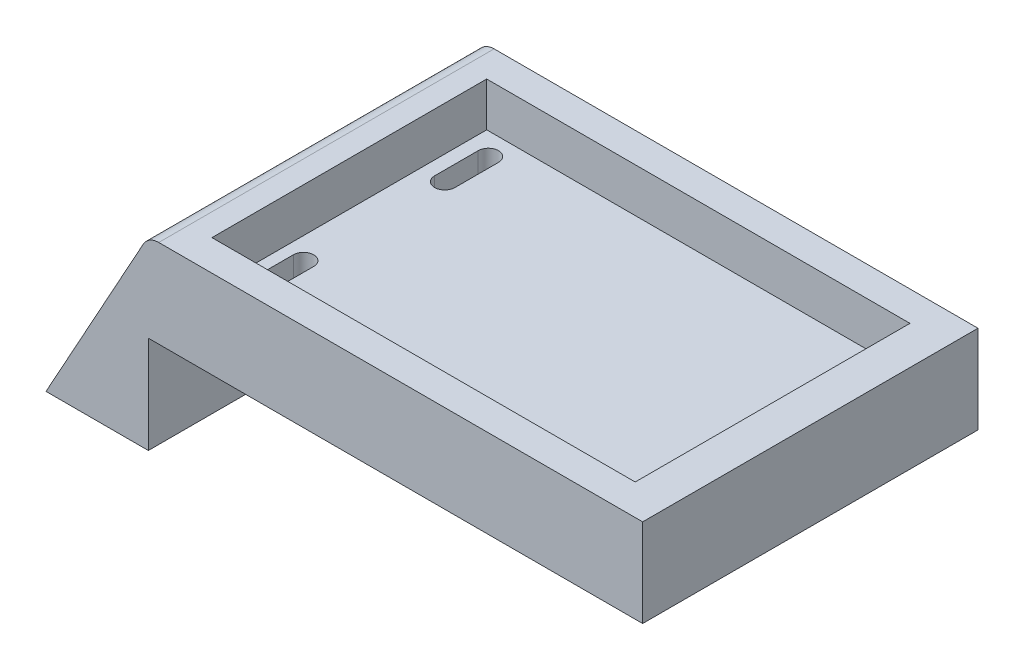
ISO-10303-21;
HEADER;
FILE_DESCRIPTION(('STEP AP214'),'2;1');
FILE_NAME('part.step','',(''),(''),'','','');
FILE_SCHEMA(('AUTOMOTIVE_DESIGN { 1 0 10303 214 1 1 1 1 }'));
ENDSEC;
DATA;
#1=APPLICATION_CONTEXT('core data for automotive mechanical design processes');
#2=APPLICATION_PROTOCOL_DEFINITION('international standard','automotive_design',2000,#1);
#3=PRODUCT_CONTEXT('',#1,'mechanical');
#4=PRODUCT('Part','Part','',(#3));
#5=PRODUCT_RELATED_PRODUCT_CATEGORY('part','',(#4));
#6=PRODUCT_DEFINITION_FORMATION('','',#4);
#7=PRODUCT_DEFINITION_CONTEXT('part definition',#1,'design');
#8=PRODUCT_DEFINITION('design','',#6,#7);
#9=PRODUCT_DEFINITION_SHAPE('','',#8);
#10=(LENGTH_UNIT() NAMED_UNIT(*) SI_UNIT(.MILLI.,.METRE.));
#11=(NAMED_UNIT(*) PLANE_ANGLE_UNIT() SI_UNIT($,.RADIAN.));
#12=(NAMED_UNIT(*) SI_UNIT($,.STERADIAN.) SOLID_ANGLE_UNIT());
#13=UNCERTAINTY_MEASURE_WITH_UNIT(LENGTH_MEASURE(1.E-05),#10,'distance_accuracy_value','');
#14=(GEOMETRIC_REPRESENTATION_CONTEXT(3) GLOBAL_UNCERTAINTY_ASSIGNED_CONTEXT((#13)) GLOBAL_UNIT_ASSIGNED_CONTEXT((#10,
#11,#12)) REPRESENTATION_CONTEXT('',''));
#15=CARTESIAN_POINT('',(0.,0.,0.));
#16=DIRECTION('',(0.,0.,1.));
#17=DIRECTION('',(1.,0.,0.));
#18=AXIS2_PLACEMENT_3D('',#15,#16,#17);
#19=CARTESIAN_POINT('',(-34.7548784400583,-12.7,-21.5329138161231));
#20=DIRECTION('',(0.,0.,-1.));
#21=DIRECTION('',(-1.,0.,0.));
#22=AXIS2_PLACEMENT_3D('',#19,#20,#21);
#23=PLANE('',#22);
#24=CARTESIAN_POINT('',(13.9227090818307,-12.7,-21.5329138161231));
#25=DIRECTION('',(0.,0.,-1.));
#26=DIRECTION('',(-1.,0.,0.));
#27=AXIS2_PLACEMENT_3D('',#24,#25,#26);
#28=CIRCLE('',#27,7.62);
#29=CARTESIAN_POINT('',(6.30270908183067,-12.7,-21.5329138161231));
#30=VERTEX_POINT('',#29);
#31=CARTESIAN_POINT('',(21.5427090818307,-12.7,-21.5329138161231));
#32=VERTEX_POINT('',#31);
#33=EDGE_CURVE('E262',#30,#32,#28,.T.);
#34=ORIENTED_EDGE('',*,*,#33,.F.);
#35=DIRECTION('',(-1.,0.,0.));
#36=VECTOR('',#35,1.);
#37=CARTESIAN_POINT('',(-34.7548784400583,-12.7,-21.5329138161231));
#38=LINE('',#37,#36);
#39=CARTESIAN_POINT('',(-34.7548784400583,-12.7,-21.5329138161231));
#40=VERTEX_POINT('',#39);
#41=EDGE_CURVE('E332',#30,#40,#38,.T.);
#42=ORIENTED_EDGE('',*,*,#41,.T.);
#43=DIRECTION('',(0.,1.,0.));
#44=VECTOR('',#43,1.);
#45=CARTESIAN_POINT('',(-34.7548784400583,-12.7,-21.5329138161231));
#46=LINE('',#45,#44);
#47=CARTESIAN_POINT('',(-34.7548784400583,-26.7296636371694,-21.5329138161231));
#48=VERTEX_POINT('',#47);
#49=EDGE_CURVE('E276',#48,#40,#46,.T.);
#50=ORIENTED_EDGE('',*,*,#49,.F.);
#51=DIRECTION('',(1.,0.,0.));
#52=VECTOR('',#51,1.);
#53=CARTESIAN_POINT('',(-34.7548784400583,-26.7296636371694,-21.5329138161231));
#54=LINE('',#53,#52);
#55=CARTESIAN_POINT('',(-49.5144814985387,-26.7296636371694,-21.5329138161231));
#56=VERTEX_POINT('',#55);
#57=EDGE_CURVE('E377',#56,#48,#54,.T.);
#58=ORIENTED_EDGE('',*,*,#57,.F.);
#59=DIRECTION('',(-0.483383688140556,-0.875408596050801,0.));
#60=VECTOR('',#59,1.);
#61=CARTESIAN_POINT('',(-49.5144814985387,-26.7296636371694,-21.5329138161231));
#62=LINE('',#61,#60);
#63=CARTESIAN_POINT('',(-35.4794528893374,-1.31220543212299,-21.5329138161231));
#64=VERTEX_POINT('',#63);
#65=EDGE_CURVE('E381',#64,#56,#62,.T.);
#66=ORIENTED_EDGE('',*,*,#65,.F.);
#67=CARTESIAN_POINT('',(-33.2559150553684,-2.54,-21.5329138161231));
#68=DIRECTION('',(0.,0.,-1.));
#69=DIRECTION('',(-1.,0.,0.));
#70=AXIS2_PLACEMENT_3D('',#67,#68,#69);
#71=CIRCLE('',#70,2.54);
#72=CARTESIAN_POINT('',(-33.2559150553684,0.,-21.5329138161231));
#73=VERTEX_POINT('',#72);
#74=EDGE_CURVE('E341',#64,#73,#71,.T.);
#75=ORIENTED_EDGE('',*,*,#74,.T.);
#76=DIRECTION('',(-1.,0.,0.));
#77=VECTOR('',#76,1.);
#78=CARTESIAN_POINT('',(-34.7548784400583,0.,-21.5329138161231));
#79=LINE('',#78,#77);
#80=CARTESIAN_POINT('',(36.5178070565831,0.,-21.5329138161231));
#81=VERTEX_POINT('',#80);
#82=EDGE_CURVE('E322',#81,#73,#79,.T.);
#83=ORIENTED_EDGE('',*,*,#82,.F.);
#84=DIRECTION('',(0.,1.,0.));
#85=VECTOR('',#84,1.);
#86=CARTESIAN_POINT('',(36.5178070565831,-12.7,-21.5329138161231));
#87=LINE('',#86,#85);
#88=CARTESIAN_POINT('',(36.5178070565831,-12.7,-21.5329138161231));
#89=VERTEX_POINT('',#88);
#90=EDGE_CURVE('E358',#89,#81,#87,.T.);
#91=ORIENTED_EDGE('',*,*,#90,.F.);
#92=EDGE_CURVE('E329',#89,#32,#38,.T.);
#93=ORIENTED_EDGE('',*,*,#92,.T.);
#94=EDGE_LOOP('',(#34,#42,#50,#58,#66,#75,#83,#91,#93));
#95=FACE_BOUND('',#94,.T.);
#96=ADVANCED_FACE('F33',(#95),#23,.T.);
#97=CARTESIAN_POINT('',(36.5178070565831,-12.7,-21.5329138161231));
#98=DIRECTION('',(1.,0.,0.));
#99=DIRECTION('',(0.,0.,-1.));
#100=AXIS2_PLACEMENT_3D('',#97,#98,#99);
#101=PLANE('',#100);
#102=DIRECTION('',(0.,0.,-1.));
#103=VECTOR('',#102,1.);
#104=CARTESIAN_POINT('',(36.5178070565831,0.,-21.5329138161231));
#105=LINE('',#104,#103);
#106=CARTESIAN_POINT('',(36.5178070565831,0.,26.8216996656972));
#107=VERTEX_POINT('',#106);
#108=EDGE_CURVE('E401',#107,#81,#105,.T.);
#109=ORIENTED_EDGE('',*,*,#108,.F.);
#110=DIRECTION('',(0.,1.,0.));
#111=VECTOR('',#110,1.);
#112=CARTESIAN_POINT('',(36.5178070565831,-12.7,26.8216996656972));
#113=LINE('',#112,#111);
#114=CARTESIAN_POINT('',(36.5178070565831,-12.7,26.8216996656972));
#115=VERTEX_POINT('',#114);
#116=EDGE_CURVE('E323',#115,#107,#113,.T.);
#117=ORIENTED_EDGE('',*,*,#116,.F.);
#118=DIRECTION('',(0.,0.,-1.));
#119=VECTOR('',#118,1.);
#120=CARTESIAN_POINT('',(36.5178070565831,-12.7,-21.5329138161231));
#121=LINE('',#120,#119);
#122=EDGE_CURVE('E314',#115,#89,#121,.T.);
#123=ORIENTED_EDGE('',*,*,#122,.T.);
#124=ORIENTED_EDGE('',*,*,#90,.T.);
#125=EDGE_LOOP('',(#109,#117,#123,#124));
#126=FACE_BOUND('',#125,.T.);
#127=ADVANCED_FACE('F414',(#126),#101,.T.);
#128=CARTESIAN_POINT('',(-34.7548784400583,-12.7,26.8216996656972));
#129=DIRECTION('',(0.,0.,1.));
#130=DIRECTION('',(1.,0.,0.));
#131=AXIS2_PLACEMENT_3D('',#128,#129,#130);
#132=PLANE('',#131);
#133=DIRECTION('',(1.,0.,0.));
#134=VECTOR('',#133,1.);
#135=CARTESIAN_POINT('',(-34.7548784400583,0.,26.8216996656972));
#136=LINE('',#135,#134);
#137=CARTESIAN_POINT('',(-33.2559150553684,0.,26.8216996656972));
#138=VERTEX_POINT('',#137);
#139=EDGE_CURVE('E305',#138,#107,#136,.T.);
#140=ORIENTED_EDGE('',*,*,#139,.F.);
#141=CARTESIAN_POINT('',(-33.2559150553684,-2.54,26.8216996656972));
#142=DIRECTION('',(0.,0.,1.));
#143=DIRECTION('',(1.,0.,0.));
#144=AXIS2_PLACEMENT_3D('',#141,#142,#143);
#145=CIRCLE('',#144,2.54);
#146=CARTESIAN_POINT('',(-35.4794528893374,-1.31220543212299,26.8216996656972));
#147=VERTEX_POINT('',#146);
#148=EDGE_CURVE('E388',#138,#147,#145,.T.);
#149=ORIENTED_EDGE('',*,*,#148,.T.);
#150=DIRECTION('',(-0.483383688140556,-0.875408596050801,0.));
#151=VECTOR('',#150,1.);
#152=CARTESIAN_POINT('',(-49.5144814985387,-26.7296636371694,26.8216996656972));
#153=LINE('',#152,#151);
#154=CARTESIAN_POINT('',(-49.5144814985387,-26.7296636371694,26.8216996656972));
#155=VERTEX_POINT('',#154);
#156=EDGE_CURVE('E275',#147,#155,#153,.T.);
#157=ORIENTED_EDGE('',*,*,#156,.T.);
#158=DIRECTION('',(1.,0.,0.));
#159=VECTOR('',#158,1.);
#160=CARTESIAN_POINT('',(-34.7548784400583,-26.7296636371694,26.8216996656972));
#161=LINE('',#160,#159);
#162=CARTESIAN_POINT('',(-34.7548784400583,-26.7296636371694,26.8216996656972));
#163=VERTEX_POINT('',#162);
#164=EDGE_CURVE('E269',#155,#163,#161,.T.);
#165=ORIENTED_EDGE('',*,*,#164,.T.);
#166=DIRECTION('',(0.,1.,0.));
#167=VECTOR('',#166,1.);
#168=CARTESIAN_POINT('',(-34.7548784400583,-12.7,26.8216996656972));
#169=LINE('',#168,#167);
#170=CARTESIAN_POINT('',(-34.7548784400583,-12.7,26.8216996656972));
#171=VERTEX_POINT('',#170);
#172=EDGE_CURVE('E265',#163,#171,#169,.T.);
#173=ORIENTED_EDGE('',*,*,#172,.T.);
#174=DIRECTION('',(1.,0.,0.));
#175=VECTOR('',#174,1.);
#176=CARTESIAN_POINT('',(-34.7548784400583,-12.7,26.8216996656972));
#177=LINE('',#176,#175);
#178=EDGE_CURVE('E321',#171,#115,#177,.T.);
#179=ORIENTED_EDGE('',*,*,#178,.T.);
#180=ORIENTED_EDGE('',*,*,#116,.T.);
#181=EDGE_LOOP('',(#140,#149,#157,#165,#173,#179,#180));
#182=FACE_BOUND('',#181,.T.);
#183=ADVANCED_FACE('F365',(#182),#132,.T.);
#184=CARTESIAN_POINT('',(0.,-12.7,0.));
#185=DIRECTION('',(0.,1.,0.));
#186=DIRECTION('',(0.,0.,1.));
#187=AXIS2_PLACEMENT_3D('',#184,#185,#186);
#188=PLANE('',#187);
#189=DIRECTION('',(0.,0.,1.));
#190=VECTOR('',#189,1.);
#191=CARTESIAN_POINT('',(-25.4358431669078,-12.7,12.2982140969415));
#192=LINE('',#191,#190);
#193=CARTESIAN_POINT('',(-25.4358431669078,-12.7,12.2982140969415));
#194=VERTEX_POINT('',#193);
#195=CARTESIAN_POINT('',(-25.4358431669078,-12.7,18.5882371670049));
#196=VERTEX_POINT('',#195);
#197=EDGE_CURVE('E210',#194,#196,#192,.T.);
#198=ORIENTED_EDGE('',*,*,#197,.F.);
#199=CARTESIAN_POINT('',(-26.9006430599363,-12.7,12.2982140969415));
#200=DIRECTION('',(0.,1.,0.));
#201=DIRECTION('',(0.,0.,1.));
#202=AXIS2_PLACEMENT_3D('',#199,#200,#201);
#203=CIRCLE('',#202,1.46479989302845);
#204=CARTESIAN_POINT('',(-28.3654429529647,-12.7,12.2982140969415));
#205=VERTEX_POINT('',#204);
#206=EDGE_CURVE('E213',#205,#194,#203,.F.);
#207=ORIENTED_EDGE('',*,*,#206,.F.);
#208=DIRECTION('',(0.,0.,-1.));
#209=VECTOR('',#208,1.);
#210=CARTESIAN_POINT('',(-28.3654429529647,-12.7,12.2982140969415));
#211=LINE('',#210,#209);
#212=CARTESIAN_POINT('',(-28.3654429529647,-12.7,18.5882371670049));
#213=VERTEX_POINT('',#212);
#214=EDGE_CURVE('E215',#213,#205,#211,.T.);
#215=ORIENTED_EDGE('',*,*,#214,.F.);
#216=CARTESIAN_POINT('',(-26.9006430599363,-12.7,18.5882371670049));
#217=DIRECTION('',(0.,1.,0.));
#218=DIRECTION('',(0.,0.,1.));
#219=AXIS2_PLACEMENT_3D('',#216,#217,#218);
#220=CIRCLE('',#219,1.46479989302845);
#221=EDGE_CURVE('E208',#196,#213,#220,.F.);
#222=ORIENTED_EDGE('',*,*,#221,.F.);
#223=EDGE_LOOP('',(#198,#207,#215,#222));
#224=FACE_BOUND('',#223,.T.);
#225=DIRECTION('',(0.,0.,1.));
#226=VECTOR('',#225,1.);
#227=CARTESIAN_POINT('',(-25.1098998323982,-12.7,-14.0284764458604));
#228=LINE('',#227,#226);
#229=CARTESIAN_POINT('',(-25.1098998323982,-12.7,-14.0284764458604));
#230=VERTEX_POINT('',#229);
#231=CARTESIAN_POINT('',(-25.1098998323982,-12.7,-7.73845337579703));
#232=VERTEX_POINT('',#231);
#233=EDGE_CURVE('E237',#230,#232,#228,.T.);
#234=ORIENTED_EDGE('',*,*,#233,.F.);
#235=CARTESIAN_POINT('',(-26.5746997254267,-12.7,-14.0284764458604));
#236=DIRECTION('',(0.,1.,0.));
#237=DIRECTION('',(0.,0.,1.));
#238=AXIS2_PLACEMENT_3D('',#235,#236,#237);
#239=CIRCLE('',#238,1.46479989302845);
#240=CARTESIAN_POINT('',(-28.0394996184551,-12.7,-14.0284764458604));
#241=VERTEX_POINT('',#240);
#242=EDGE_CURVE('E240',#241,#230,#239,.F.);
#243=ORIENTED_EDGE('',*,*,#242,.F.);
#244=DIRECTION('',(0.,0.,-1.));
#245=VECTOR('',#244,1.);
#246=CARTESIAN_POINT('',(-28.0394996184551,-12.7,-14.0284764458604));
#247=LINE('',#246,#245);
#248=CARTESIAN_POINT('',(-28.0394996184551,-12.7,-7.73845337579703));
#249=VERTEX_POINT('',#248);
#250=EDGE_CURVE('E242',#249,#241,#247,.T.);
#251=ORIENTED_EDGE('',*,*,#250,.F.);
#252=CARTESIAN_POINT('',(-26.5746997254267,-12.7,-7.73845337579703));
#253=DIRECTION('',(0.,1.,0.));
#254=DIRECTION('',(0.,0.,1.));
#255=AXIS2_PLACEMENT_3D('',#252,#253,#254);
#256=CIRCLE('',#255,1.46479989302845);
#257=EDGE_CURVE('E234',#232,#249,#256,.F.);
#258=ORIENTED_EDGE('',*,*,#257,.F.);
#259=EDGE_LOOP('',(#234,#243,#251,#258));
#260=FACE_BOUND('',#259,.T.);
#261=DIRECTION('',(-1.,0.,0.));
#262=VECTOR('',#261,1.);
#263=CARTESIAN_POINT('',(0.,-12.7,-18.9929138161231));
#264=LINE('',#263,#262);
#265=CARTESIAN_POINT('',(21.5427090818307,-12.7,-18.9929138161231));
#266=VERTEX_POINT('',#265);
#267=CARTESIAN_POINT('',(6.30270908183067,-12.7,-18.9929138161231));
#268=VERTEX_POINT('',#267);
#269=EDGE_CURVE('E343',#266,#268,#264,.T.);
#270=ORIENTED_EDGE('',*,*,#269,.F.);
#271=DIRECTION('',(0.,0.,-1.));
#272=VECTOR('',#271,1.);
#273=CARTESIAN_POINT('',(21.5427090818307,-12.7,-18.9929138161231));
#274=LINE('',#273,#272);
#275=EDGE_CURVE('E11',#266,#32,#274,.T.);
#276=ORIENTED_EDGE('',*,*,#275,.T.);
#277=ORIENTED_EDGE('',*,*,#92,.F.);
#278=ORIENTED_EDGE('',*,*,#122,.F.);
#279=ORIENTED_EDGE('',*,*,#178,.F.);
#280=DIRECTION('',(0.,0.,1.));
#281=VECTOR('',#280,1.);
#282=CARTESIAN_POINT('',(-34.7548784400583,-12.7,-21.5329138161231));
#283=LINE('',#282,#281);
#284=EDGE_CURVE('E317',#40,#171,#283,.T.);
#285=ORIENTED_EDGE('',*,*,#284,.F.);
#286=ORIENTED_EDGE('',*,*,#41,.F.);
#287=DIRECTION('',(0.,0.,-1.));
#288=VECTOR('',#287,1.);
#289=CARTESIAN_POINT('',(6.30270908183067,-12.7,-18.9929138161231));
#290=LINE('',#289,#288);
#291=EDGE_CURVE('E41',#30,#268,#290,.F.);
#292=ORIENTED_EDGE('',*,*,#291,.T.);
#293=EDGE_LOOP('',(#270,#276,#277,#278,#279,#285,#286,#292));
#294=FACE_BOUND('',#293,.T.);
#295=ADVANCED_FACE('F348',(#224,#260,#294),#188,.F.);
#296=CARTESIAN_POINT('',(0.,0.,0.));
#297=DIRECTION('',(0.,1.,0.));
#298=DIRECTION('',(0.,0.,1.));
#299=AXIS2_PLACEMENT_3D('',#296,#297,#298);
#300=PLANE('',#299);
#301=DIRECTION('',(0.,0.,1.));
#302=VECTOR('',#301,1.);
#303=CARTESIAN_POINT('',(-30.0270973551157,0.,-17.2355941958845));
#304=LINE('',#303,#302);
#305=CARTESIAN_POINT('',(-30.0270973551157,0.,-17.2355941958845));
#306=VERTEX_POINT('',#305);
#307=CARTESIAN_POINT('',(-30.0270973551157,0.,22.3816153264591));
#308=VERTEX_POINT('',#307);
#309=EDGE_CURVE('E293',#306,#308,#304,.T.);
#310=ORIENTED_EDGE('',*,*,#309,.F.);
#311=DIRECTION('',(-1.,0.,0.));
#312=VECTOR('',#311,1.);
#313=CARTESIAN_POINT('',(-30.0270973551157,0.,-17.2355941958845));
#314=LINE('',#313,#312);
#315=CARTESIAN_POINT('',(31.0048200171435,0.,-17.2355941958845));
#316=VERTEX_POINT('',#315);
#317=EDGE_CURVE('E283',#316,#306,#314,.T.);
#318=ORIENTED_EDGE('',*,*,#317,.F.);
#319=DIRECTION('',(0.,0.,-1.));
#320=VECTOR('',#319,1.);
#321=CARTESIAN_POINT('',(31.0048200171435,0.,-17.2355941958845));
#322=LINE('',#321,#320);
#323=CARTESIAN_POINT('',(31.0048200171435,0.,22.3816153264591));
#324=VERTEX_POINT('',#323);
#325=EDGE_CURVE('E298',#324,#316,#322,.T.);
#326=ORIENTED_EDGE('',*,*,#325,.F.);
#327=DIRECTION('',(1.,0.,0.));
#328=VECTOR('',#327,1.);
#329=CARTESIAN_POINT('',(-30.0270973551157,0.,22.3816153264591));
#330=LINE('',#329,#328);
#331=EDGE_CURVE('E295',#308,#324,#330,.T.);
#332=ORIENTED_EDGE('',*,*,#331,.F.);
#333=EDGE_LOOP('',(#310,#318,#326,#332));
#334=FACE_BOUND('',#333,.T.);
#335=ORIENTED_EDGE('',*,*,#82,.T.);
#336=DIRECTION('',(0.,0.,1.));
#337=VECTOR('',#336,1.);
#338=CARTESIAN_POINT('',(-33.2559150553684,0.,0.));
#339=LINE('',#338,#337);
#340=EDGE_CURVE('E335',#73,#138,#339,.T.);
#341=ORIENTED_EDGE('',*,*,#340,.T.);
#342=ORIENTED_EDGE('',*,*,#139,.T.);
#343=ORIENTED_EDGE('',*,*,#108,.T.);
#344=EDGE_LOOP('',(#335,#341,#342,#343));
#345=FACE_BOUND('',#344,.T.);
#346=ADVANCED_FACE('F402',(#334,#345),#300,.T.);
#347=CARTESIAN_POINT('',(-30.0270973551157,-6.35,-17.2355941958845));
#348=DIRECTION('',(-1.,0.,0.));
#349=DIRECTION('',(0.,0.,1.));
#350=AXIS2_PLACEMENT_3D('',#347,#348,#349);
#351=PLANE('',#350);
#352=ORIENTED_EDGE('',*,*,#309,.T.);
#353=DIRECTION('',(0.,1.,0.));
#354=VECTOR('',#353,1.);
#355=CARTESIAN_POINT('',(-30.0270973551157,-6.35,22.3816153264591));
#356=LINE('',#355,#354);
#357=CARTESIAN_POINT('',(-30.0270973551157,-6.35,22.3816153264591));
#358=VERTEX_POINT('',#357);
#359=EDGE_CURVE('E292',#358,#308,#356,.T.);
#360=ORIENTED_EDGE('',*,*,#359,.F.);
#361=DIRECTION('',(0.,0.,1.));
#362=VECTOR('',#361,1.);
#363=CARTESIAN_POINT('',(-30.0270973551157,-6.35,-17.2355941958845));
#364=LINE('',#363,#362);
#365=CARTESIAN_POINT('',(-30.0270973551157,-6.35,-17.2355941958845));
#366=VERTEX_POINT('',#365);
#367=EDGE_CURVE('E279',#366,#358,#364,.T.);
#368=ORIENTED_EDGE('',*,*,#367,.F.);
#369=DIRECTION('',(0.,1.,0.));
#370=VECTOR('',#369,1.);
#371=CARTESIAN_POINT('',(-30.0270973551157,-6.35,-17.2355941958845));
#372=LINE('',#371,#370);
#373=EDGE_CURVE('E303',#366,#306,#372,.T.);
#374=ORIENTED_EDGE('',*,*,#373,.T.);
#375=EDGE_LOOP('',(#352,#360,#368,#374));
#376=FACE_BOUND('',#375,.T.);
#377=ADVANCED_FACE('F430',(#376),#351,.F.);
#378=CARTESIAN_POINT('',(-30.0270973551157,-6.35,-17.2355941958845));
#379=DIRECTION('',(0.,0.,-1.));
#380=DIRECTION('',(-1.,0.,0.));
#381=AXIS2_PLACEMENT_3D('',#378,#379,#380);
#382=PLANE('',#381);
#383=ORIENTED_EDGE('',*,*,#317,.T.);
#384=ORIENTED_EDGE('',*,*,#373,.F.);
#385=DIRECTION('',(-1.,0.,0.));
#386=VECTOR('',#385,1.);
#387=CARTESIAN_POINT('',(-30.0270973551157,-6.35,-17.2355941958845));
#388=LINE('',#387,#386);
#389=CARTESIAN_POINT('',(31.0048200171435,-6.35,-17.2355941958845));
#390=VERTEX_POINT('',#389);
#391=EDGE_CURVE('E289',#390,#366,#388,.T.);
#392=ORIENTED_EDGE('',*,*,#391,.F.);
#393=DIRECTION('',(0.,1.,0.));
#394=VECTOR('',#393,1.);
#395=CARTESIAN_POINT('',(31.0048200171435,-6.35,-17.2355941958845));
#396=LINE('',#395,#394);
#397=EDGE_CURVE('E306',#390,#316,#396,.T.);
#398=ORIENTED_EDGE('',*,*,#397,.T.);
#399=EDGE_LOOP('',(#383,#384,#392,#398));
#400=FACE_BOUND('',#399,.T.);
#401=ADVANCED_FACE('F437',(#400),#382,.F.);
#402=CARTESIAN_POINT('',(31.0048200171435,-6.35,-17.2355941958845));
#403=DIRECTION('',(1.,0.,0.));
#404=DIRECTION('',(0.,0.,-1.));
#405=AXIS2_PLACEMENT_3D('',#402,#403,#404);
#406=PLANE('',#405);
#407=ORIENTED_EDGE('',*,*,#325,.T.);
#408=ORIENTED_EDGE('',*,*,#397,.F.);
#409=DIRECTION('',(0.,0.,-1.));
#410=VECTOR('',#409,1.);
#411=CARTESIAN_POINT('',(31.0048200171435,-6.35,-17.2355941958845));
#412=LINE('',#411,#410);
#413=CARTESIAN_POINT('',(31.0048200171435,-6.35,22.3816153264591));
#414=VERTEX_POINT('',#413);
#415=EDGE_CURVE('E286',#414,#390,#412,.T.);
#416=ORIENTED_EDGE('',*,*,#415,.F.);
#417=DIRECTION('',(0.,1.,0.));
#418=VECTOR('',#417,1.);
#419=CARTESIAN_POINT('',(31.0048200171435,-6.35,22.3816153264591));
#420=LINE('',#419,#418);
#421=EDGE_CURVE('E308',#414,#324,#420,.T.);
#422=ORIENTED_EDGE('',*,*,#421,.T.);
#423=EDGE_LOOP('',(#407,#408,#416,#422));
#424=FACE_BOUND('',#423,.T.);
#425=ADVANCED_FACE('F442',(#424),#406,.F.);
#426=CARTESIAN_POINT('',(-30.0270973551157,-6.35,22.3816153264591));
#427=DIRECTION('',(0.,0.,1.));
#428=DIRECTION('',(1.,0.,0.));
#429=AXIS2_PLACEMENT_3D('',#426,#427,#428);
#430=PLANE('',#429);
#431=ORIENTED_EDGE('',*,*,#331,.T.);
#432=ORIENTED_EDGE('',*,*,#421,.F.);
#433=DIRECTION('',(1.,0.,0.));
#434=VECTOR('',#433,1.);
#435=CARTESIAN_POINT('',(-30.0270973551157,-6.35,22.3816153264591));
#436=LINE('',#435,#434);
#437=EDGE_CURVE('E282',#358,#414,#436,.T.);
#438=ORIENTED_EDGE('',*,*,#437,.F.);
#439=ORIENTED_EDGE('',*,*,#359,.T.);
#440=EDGE_LOOP('',(#431,#432,#438,#439));
#441=FACE_BOUND('',#440,.T.);
#442=ADVANCED_FACE('F439',(#441),#430,.F.);
#443=CARTESIAN_POINT('',(0.,-6.35,0.));
#444=DIRECTION('',(0.,1.,0.));
#445=DIRECTION('',(0.,0.,1.));
#446=AXIS2_PLACEMENT_3D('',#443,#444,#445);
#447=PLANE('',#446);
#448=CARTESIAN_POINT('',(-26.9006430599363,-6.35,12.2982140969415));
#449=DIRECTION('',(0.,1.,0.));
#450=DIRECTION('',(0.,0.,1.));
#451=AXIS2_PLACEMENT_3D('',#448,#449,#450);
#452=CIRCLE('',#451,1.46479989302845);
#453=CARTESIAN_POINT('',(-25.4358431669078,-6.35,12.2982140969415));
#454=VERTEX_POINT('',#453);
#455=CARTESIAN_POINT('',(-28.3654429529647,-6.35,12.2982140969415));
#456=VERTEX_POINT('',#455);
#457=EDGE_CURVE('E193',#454,#456,#452,.T.);
#458=ORIENTED_EDGE('',*,*,#457,.F.);
#459=DIRECTION('',(0.,0.,-1.));
#460=VECTOR('',#459,1.);
#461=CARTESIAN_POINT('',(-25.4358431669078,-6.35,12.2982140969415));
#462=LINE('',#461,#460);
#463=CARTESIAN_POINT('',(-25.4358431669078,-6.35,18.5882371670049));
#464=VERTEX_POINT('',#463);
#465=EDGE_CURVE('E222',#464,#454,#462,.T.);
#466=ORIENTED_EDGE('',*,*,#465,.F.);
#467=CARTESIAN_POINT('',(-26.9006430599363,-6.35,18.5882371670049));
#468=DIRECTION('',(0.,1.,0.));
#469=DIRECTION('',(0.,0.,1.));
#470=AXIS2_PLACEMENT_3D('',#467,#468,#469);
#471=CIRCLE('',#470,1.46479989302845);
#472=CARTESIAN_POINT('',(-28.3654429529647,-6.35,18.5882371670049));
#473=VERTEX_POINT('',#472);
#474=EDGE_CURVE('E219',#473,#464,#471,.T.);
#475=ORIENTED_EDGE('',*,*,#474,.F.);
#476=DIRECTION('',(0.,0.,1.));
#477=VECTOR('',#476,1.);
#478=CARTESIAN_POINT('',(-28.3654429529647,-6.35,12.2982140969415));
#479=LINE('',#478,#477);
#480=EDGE_CURVE('E217',#456,#473,#479,.T.);
#481=ORIENTED_EDGE('',*,*,#480,.F.);
#482=EDGE_LOOP('',(#458,#466,#475,#481));
#483=FACE_BOUND('',#482,.T.);
#484=CARTESIAN_POINT('',(-26.5746997254267,-6.35,-14.0284764458604));
#485=DIRECTION('',(0.,1.,0.));
#486=DIRECTION('',(0.,0.,1.));
#487=AXIS2_PLACEMENT_3D('',#484,#485,#486);
#488=CIRCLE('',#487,1.46479989302845);
#489=CARTESIAN_POINT('',(-25.1098998323982,-6.35,-14.0284764458604));
#490=VERTEX_POINT('',#489);
#491=CARTESIAN_POINT('',(-28.0394996184551,-6.35,-14.0284764458604));
#492=VERTEX_POINT('',#491);
#493=EDGE_CURVE('E233',#490,#492,#488,.T.);
#494=ORIENTED_EDGE('',*,*,#493,.F.);
#495=DIRECTION('',(0.,0.,-1.));
#496=VECTOR('',#495,1.);
#497=CARTESIAN_POINT('',(-25.1098998323982,-6.35,-14.0284764458604));
#498=LINE('',#497,#496);
#499=CARTESIAN_POINT('',(-25.1098998323982,-6.35,-7.73845337579703));
#500=VERTEX_POINT('',#499);
#501=EDGE_CURVE('E250',#500,#490,#498,.T.);
#502=ORIENTED_EDGE('',*,*,#501,.F.);
#503=CARTESIAN_POINT('',(-26.5746997254267,-6.35,-7.73845337579703));
#504=DIRECTION('',(0.,1.,0.));
#505=DIRECTION('',(0.,0.,1.));
#506=AXIS2_PLACEMENT_3D('',#503,#504,#505);
#507=CIRCLE('',#506,1.46479989302845);
#508=CARTESIAN_POINT('',(-28.0394996184551,-6.35,-7.73845337579703));
#509=VERTEX_POINT('',#508);
#510=EDGE_CURVE('E247',#509,#500,#507,.T.);
#511=ORIENTED_EDGE('',*,*,#510,.F.);
#512=DIRECTION('',(0.,0.,1.));
#513=VECTOR('',#512,1.);
#514=CARTESIAN_POINT('',(-28.0394996184551,-6.35,-14.0284764458604));
#515=LINE('',#514,#513);
#516=EDGE_CURVE('E244',#492,#509,#515,.T.);
#517=ORIENTED_EDGE('',*,*,#516,.F.);
#518=EDGE_LOOP('',(#494,#502,#511,#517));
#519=FACE_BOUND('',#518,.T.);
#520=ORIENTED_EDGE('',*,*,#367,.T.);
#521=ORIENTED_EDGE('',*,*,#437,.T.);
#522=ORIENTED_EDGE('',*,*,#415,.T.);
#523=ORIENTED_EDGE('',*,*,#391,.T.);
#524=EDGE_LOOP('',(#520,#521,#522,#523));
#525=FACE_BOUND('',#524,.T.);
#526=ADVANCED_FACE('F411',(#483,#519,#525),#447,.T.);
#527=CARTESIAN_POINT('',(-49.5144814985387,-26.7296636371694,-52.0668424955466));
#528=DIRECTION('',(-0.875408596050801,0.483383688140556,0.));
#529=DIRECTION('',(-0.483383688140556,-0.875408596050801,0.));
#530=AXIS2_PLACEMENT_3D('',#527,#528,#529);
#531=PLANE('',#530);
#532=ORIENTED_EDGE('',*,*,#156,.F.);
#533=DIRECTION('',(0.,0.,1.));
#534=VECTOR('',#533,1.);
#535=CARTESIAN_POINT('',(-35.4794528893374,-1.31220543212299,-52.0668424955466));
#536=LINE('',#535,#534);
#537=EDGE_CURVE('E391',#147,#64,#536,.F.);
#538=ORIENTED_EDGE('',*,*,#537,.T.);
#539=ORIENTED_EDGE('',*,*,#65,.T.);
#540=DIRECTION('',(0.,0.,1.));
#541=VECTOR('',#540,1.);
#542=CARTESIAN_POINT('',(-49.5144814985387,-26.7296636371694,-52.0668424955466));
#543=LINE('',#542,#541);
#544=EDGE_CURVE('E379',#56,#155,#543,.T.);
#545=ORIENTED_EDGE('',*,*,#544,.T.);
#546=EDGE_LOOP('',(#532,#538,#539,#545));
#547=FACE_BOUND('',#546,.T.);
#548=ADVANCED_FACE('F390',(#547),#531,.T.);
#549=CARTESIAN_POINT('',(-34.7548784400583,-26.7296636371694,-52.0668424955466));
#550=DIRECTION('',(0.,-1.,0.));
#551=DIRECTION('',(0.,0.,-1.));
#552=AXIS2_PLACEMENT_3D('',#549,#550,#551);
#553=PLANE('',#552);
#554=CARTESIAN_POINT('',(-34.7548784400583,-26.7296636371694,2.64439292478705));
#555=DIRECTION('',(0.,-1.,0.));
#556=DIRECTION('',(0.,0.,-1.));
#557=AXIS2_PLACEMENT_3D('',#554,#555,#556);
#558=CIRCLE('',#557,6.1837307243377);
#559=CARTESIAN_POINT('',(-34.7548784400583,-26.7296636371694,8.82812364912475));
#560=VERTEX_POINT('',#559);
#561=CARTESIAN_POINT('',(-34.7548784400583,-26.7296636371694,-3.53933779955064));
#562=VERTEX_POINT('',#561);
#563=EDGE_CURVE('E48',#560,#562,#558,.T.);
#564=ORIENTED_EDGE('',*,*,#563,.F.);
#565=DIRECTION('',(0.,0.,1.));
#566=VECTOR('',#565,1.);
#567=CARTESIAN_POINT('',(-34.7548784400583,-26.7296636371694,-52.0668424955466));
#568=LINE('',#567,#566);
#569=EDGE_CURVE('E370',#560,#163,#568,.T.);
#570=ORIENTED_EDGE('',*,*,#569,.T.);
#571=ORIENTED_EDGE('',*,*,#164,.F.);
#572=ORIENTED_EDGE('',*,*,#544,.F.);
#573=ORIENTED_EDGE('',*,*,#57,.T.);
#574=EDGE_CURVE('E372',#48,#562,#568,.T.);
#575=ORIENTED_EDGE('',*,*,#574,.T.);
#576=EDGE_LOOP('',(#564,#570,#571,#572,#573,#575));
#577=FACE_BOUND('',#576,.T.);
#578=ADVANCED_FACE('F403',(#577),#553,.T.);
#579=CARTESIAN_POINT('',(-34.7548784400583,-12.7,-52.0668424955466));
#580=DIRECTION('',(1.,0.,0.));
#581=DIRECTION('',(0.,0.,-1.));
#582=AXIS2_PLACEMENT_3D('',#579,#580,#581);
#583=PLANE('',#582);
#584=DIRECTION('',(0.,0.959315799354055,-0.282335256582828));
#585=VECTOR('',#584,1.);
#586=CARTESIAN_POINT('',(-34.7548784400583,-13.5483287562623,4.94873839537312));
#587=LINE('',#586,#585);
#588=CARTESIAN_POINT('',(-34.7548784400583,-13.5483287562623,4.94873839537312));
#589=VERTEX_POINT('',#588);
#590=EDGE_CURVE('E200',#560,#589,#587,.T.);
#591=ORIENTED_EDGE('',*,*,#590,.T.);
#592=DIRECTION('',(0.,0.,-1.));
#593=VECTOR('',#592,1.);
#594=CARTESIAN_POINT('',(-34.7548784400583,-13.5483287562623,2.64439292478705));
#595=LINE('',#594,#593);
#596=CARTESIAN_POINT('',(-34.7548784400583,-13.5483287562623,0.340047454200985));
#597=VERTEX_POINT('',#596);
#598=EDGE_CURVE('E191',#589,#597,#595,.T.);
#599=ORIENTED_EDGE('',*,*,#598,.T.);
#600=DIRECTION('',(0.,0.959315799354055,0.282335256582828));
#601=VECTOR('',#600,1.);
#602=CARTESIAN_POINT('',(-34.7548784400583,-13.5483287562623,0.340047454200985));
#603=LINE('',#602,#601);
#604=EDGE_CURVE('E195',#562,#597,#603,.T.);
#605=ORIENTED_EDGE('',*,*,#604,.F.);
#606=ORIENTED_EDGE('',*,*,#574,.F.);
#607=ORIENTED_EDGE('',*,*,#49,.T.);
#608=ORIENTED_EDGE('',*,*,#284,.T.);
#609=ORIENTED_EDGE('',*,*,#172,.F.);
#610=ORIENTED_EDGE('',*,*,#569,.F.);
#611=EDGE_LOOP('',(#591,#599,#605,#606,#607,#608,#609,#610));
#612=FACE_BOUND('',#611,.T.);
#613=ADVANCED_FACE('F202',(#612),#583,.T.);
#614=CARTESIAN_POINT('',(-33.2559150553684,-2.54,0.));
#615=DIRECTION('',(0.,0.,1.));
#616=DIRECTION('',(1.,0.,0.));
#617=AXIS2_PLACEMENT_3D('',#614,#615,#616);
#618=CYLINDRICAL_SURFACE('',#617,2.54);
#619=ORIENTED_EDGE('',*,*,#74,.F.);
#620=ORIENTED_EDGE('',*,*,#537,.F.);
#621=ORIENTED_EDGE('',*,*,#148,.F.);
#622=ORIENTED_EDGE('',*,*,#340,.F.);
#623=EDGE_LOOP('',(#619,#620,#621,#622));
#624=FACE_BOUND('',#623,.T.);
#625=ADVANCED_FACE('F35',(#624),#618,.T.);
#626=CARTESIAN_POINT('',(13.9227090818307,-12.7,-18.9929138161231));
#627=DIRECTION('',(0.,0.,-1.));
#628=DIRECTION('',(-1.,0.,0.));
#629=AXIS2_PLACEMENT_3D('',#626,#627,#628);
#630=CYLINDRICAL_SURFACE('',#629,7.62);
#631=CARTESIAN_POINT('',(13.9227090818307,-12.7,-18.9929138161231));
#632=DIRECTION('',(0.,0.,-1.));
#633=DIRECTION('',(-1.,0.,0.));
#634=AXIS2_PLACEMENT_3D('',#631,#632,#633);
#635=CIRCLE('',#634,7.62);
#636=EDGE_CURVE('E263',#268,#266,#635,.T.);
#637=ORIENTED_EDGE('',*,*,#636,.F.);
#638=ORIENTED_EDGE('',*,*,#291,.F.);
#639=ORIENTED_EDGE('',*,*,#33,.T.);
#640=ORIENTED_EDGE('',*,*,#275,.F.);
#641=EDGE_LOOP('',(#637,#638,#639,#640));
#642=FACE_BOUND('',#641,.T.);
#643=ADVANCED_FACE('F353',(#642),#630,.F.);
#644=CARTESIAN_POINT('',(13.9227090818307,-12.7,-18.9929138161231));
#645=DIRECTION('',(0.,0.,-1.));
#646=DIRECTION('',(-1.,0.,0.));
#647=AXIS2_PLACEMENT_3D('',#644,#645,#646);
#648=PLANE('',#647);
#649=ORIENTED_EDGE('',*,*,#269,.T.);
#650=ORIENTED_EDGE('',*,*,#636,.T.);
#651=EDGE_LOOP('',(#649,#650));
#652=FACE_BOUND('',#651,.T.);
#653=ADVANCED_FACE('F499',(#652),#648,.T.);
#654=CARTESIAN_POINT('',(-26.5746997254267,-22.3738823910341,-14.0284764458604));
#655=DIRECTION('',(0.,1.,0.));
#656=DIRECTION('',(0.,0.,1.));
#657=AXIS2_PLACEMENT_3D('',#654,#655,#656);
#658=CYLINDRICAL_SURFACE('',#657,1.46479989302845);
#659=ORIENTED_EDGE('',*,*,#242,.T.);
#660=DIRECTION('',(0.,1.,0.));
#661=VECTOR('',#660,1.);
#662=CARTESIAN_POINT('',(-25.1098998323982,-22.3738823910341,-14.0284764458604));
#663=LINE('',#662,#661);
#664=EDGE_CURVE('E238',#230,#490,#663,.T.);
#665=ORIENTED_EDGE('',*,*,#664,.T.);
#666=ORIENTED_EDGE('',*,*,#493,.T.);
#667=DIRECTION('',(0.,1.,0.));
#668=VECTOR('',#667,1.);
#669=CARTESIAN_POINT('',(-28.0394996184551,-22.3738823910341,-14.0284764458604));
#670=LINE('',#669,#668);
#671=EDGE_CURVE('E253',#241,#492,#670,.T.);
#672=ORIENTED_EDGE('',*,*,#671,.F.);
#673=EDGE_LOOP('',(#659,#665,#666,#672));
#674=FACE_BOUND('',#673,.T.);
#675=ADVANCED_FACE('F473',(#674),#658,.F.);
#676=CARTESIAN_POINT('',(-25.1098998323982,-22.3738823910341,-14.0284764458604));
#677=DIRECTION('',(1.,0.,0.));
#678=DIRECTION('',(0.,0.,-1.));
#679=AXIS2_PLACEMENT_3D('',#676,#677,#678);
#680=PLANE('',#679);
#681=ORIENTED_EDGE('',*,*,#233,.T.);
#682=DIRECTION('',(0.,1.,0.));
#683=VECTOR('',#682,1.);
#684=CARTESIAN_POINT('',(-25.1098998323982,-22.3738823910341,-7.73845337579703));
#685=LINE('',#684,#683);
#686=EDGE_CURVE('E255',#232,#500,#685,.T.);
#687=ORIENTED_EDGE('',*,*,#686,.T.);
#688=ORIENTED_EDGE('',*,*,#501,.T.);
#689=ORIENTED_EDGE('',*,*,#664,.F.);
#690=EDGE_LOOP('',(#681,#687,#688,#689));
#691=FACE_BOUND('',#690,.T.);
#692=ADVANCED_FACE('F482',(#691),#680,.F.);
#693=CARTESIAN_POINT('',(-26.5746997254267,-22.3738823910341,-7.73845337579703));
#694=DIRECTION('',(0.,1.,0.));
#695=DIRECTION('',(0.,0.,1.));
#696=AXIS2_PLACEMENT_3D('',#693,#694,#695);
#697=CYLINDRICAL_SURFACE('',#696,1.46479989302845);
#698=ORIENTED_EDGE('',*,*,#257,.T.);
#699=DIRECTION('',(0.,1.,0.));
#700=VECTOR('',#699,1.);
#701=CARTESIAN_POINT('',(-28.0394996184551,-22.3738823910341,-7.73845337579703));
#702=LINE('',#701,#700);
#703=EDGE_CURVE('E257',#249,#509,#702,.T.);
#704=ORIENTED_EDGE('',*,*,#703,.T.);
#705=ORIENTED_EDGE('',*,*,#510,.T.);
#706=ORIENTED_EDGE('',*,*,#686,.F.);
#707=EDGE_LOOP('',(#698,#704,#705,#706));
#708=FACE_BOUND('',#707,.T.);
#709=ADVANCED_FACE('F485',(#708),#697,.F.);
#710=CARTESIAN_POINT('',(-28.0394996184551,-22.3738823910341,-14.0284764458604));
#711=DIRECTION('',(-1.,0.,0.));
#712=DIRECTION('',(0.,0.,1.));
#713=AXIS2_PLACEMENT_3D('',#710,#711,#712);
#714=PLANE('',#713);
#715=ORIENTED_EDGE('',*,*,#250,.T.);
#716=ORIENTED_EDGE('',*,*,#671,.T.);
#717=ORIENTED_EDGE('',*,*,#516,.T.);
#718=ORIENTED_EDGE('',*,*,#703,.F.);
#719=EDGE_LOOP('',(#715,#716,#717,#718));
#720=FACE_BOUND('',#719,.T.);
#721=ADVANCED_FACE('F477',(#720),#714,.F.);
#722=CARTESIAN_POINT('',(-26.9006430599363,-22.3738823910341,12.2982140969415));
#723=DIRECTION('',(0.,1.,0.));
#724=DIRECTION('',(0.,0.,1.));
#725=AXIS2_PLACEMENT_3D('',#722,#723,#724);
#726=CYLINDRICAL_SURFACE('',#725,1.46479989302845);
#727=ORIENTED_EDGE('',*,*,#206,.T.);
#728=DIRECTION('',(0.,1.,0.));
#729=VECTOR('',#728,1.);
#730=CARTESIAN_POINT('',(-25.4358431669078,-22.3738823910341,12.2982140969415));
#731=LINE('',#730,#729);
#732=EDGE_CURVE('E211',#194,#454,#731,.T.);
#733=ORIENTED_EDGE('',*,*,#732,.T.);
#734=ORIENTED_EDGE('',*,*,#457,.T.);
#735=DIRECTION('',(0.,1.,0.));
#736=VECTOR('',#735,1.);
#737=CARTESIAN_POINT('',(-28.3654429529647,-22.3738823910341,12.2982140969415));
#738=LINE('',#737,#736);
#739=EDGE_CURVE('E225',#205,#456,#738,.T.);
#740=ORIENTED_EDGE('',*,*,#739,.F.);
#741=EDGE_LOOP('',(#727,#733,#734,#740));
#742=FACE_BOUND('',#741,.T.);
#743=ADVANCED_FACE('F492',(#742),#726,.F.);
#744=CARTESIAN_POINT('',(-25.4358431669078,-22.3738823910341,12.2982140969415));
#745=DIRECTION('',(1.,0.,0.));
#746=DIRECTION('',(0.,0.,-1.));
#747=AXIS2_PLACEMENT_3D('',#744,#745,#746);
#748=PLANE('',#747);
#749=ORIENTED_EDGE('',*,*,#197,.T.);
#750=DIRECTION('',(0.,1.,0.));
#751=VECTOR('',#750,1.);
#752=CARTESIAN_POINT('',(-25.4358431669078,-22.3738823910341,18.5882371670049));
#753=LINE('',#752,#751);
#754=EDGE_CURVE('E227',#196,#464,#753,.T.);
#755=ORIENTED_EDGE('',*,*,#754,.T.);
#756=ORIENTED_EDGE('',*,*,#465,.T.);
#757=ORIENTED_EDGE('',*,*,#732,.F.);
#758=EDGE_LOOP('',(#749,#755,#756,#757));
#759=FACE_BOUND('',#758,.T.);
#760=ADVANCED_FACE('F542',(#759),#748,.F.);
#761=CARTESIAN_POINT('',(-26.9006430599363,-22.3738823910341,18.5882371670049));
#762=DIRECTION('',(0.,1.,0.));
#763=DIRECTION('',(0.,0.,1.));
#764=AXIS2_PLACEMENT_3D('',#761,#762,#763);
#765=CYLINDRICAL_SURFACE('',#764,1.46479989302845);
#766=ORIENTED_EDGE('',*,*,#221,.T.);
#767=DIRECTION('',(0.,1.,0.));
#768=VECTOR('',#767,1.);
#769=CARTESIAN_POINT('',(-28.3654429529647,-22.3738823910341,18.5882371670049));
#770=LINE('',#769,#768);
#771=EDGE_CURVE('E56',#213,#473,#770,.T.);
#772=ORIENTED_EDGE('',*,*,#771,.T.);
#773=ORIENTED_EDGE('',*,*,#474,.T.);
#774=ORIENTED_EDGE('',*,*,#754,.F.);
#775=EDGE_LOOP('',(#766,#772,#773,#774));
#776=FACE_BOUND('',#775,.T.);
#777=ADVANCED_FACE('F545',(#776),#765,.F.);
#778=CARTESIAN_POINT('',(-28.3654429529647,-22.3738823910341,12.2982140969415));
#779=DIRECTION('',(-1.,0.,0.));
#780=DIRECTION('',(0.,0.,1.));
#781=AXIS2_PLACEMENT_3D('',#778,#779,#780);
#782=PLANE('',#781);
#783=ORIENTED_EDGE('',*,*,#214,.T.);
#784=ORIENTED_EDGE('',*,*,#739,.T.);
#785=ORIENTED_EDGE('',*,*,#480,.T.);
#786=ORIENTED_EDGE('',*,*,#771,.F.);
#787=EDGE_LOOP('',(#783,#784,#785,#786));
#788=FACE_BOUND('',#787,.T.);
#789=ADVANCED_FACE('F527',(#788),#782,.F.);
#790=CARTESIAN_POINT('',(-34.7548784400583,-13.5483287562623,2.64439292478705));
#791=DIRECTION('',(0.,1.,0.));
#792=DIRECTION('',(0.,0.,1.));
#793=AXIS2_PLACEMENT_3D('',#790,#791,#792);
#794=PLANE('',#793);
#795=CARTESIAN_POINT('',(-34.7548784400583,-13.5483287562623,2.64439292478705));
#796=DIRECTION('',(0.,-1.,0.));
#797=DIRECTION('',(0.,0.,-1.));
#798=AXIS2_PLACEMENT_3D('',#795,#796,#797);
#799=CIRCLE('',#798,2.30434547058607);
#800=EDGE_CURVE('E188',#589,#597,#799,.T.);
#801=ORIENTED_EDGE('',*,*,#800,.T.);
#802=ORIENTED_EDGE('',*,*,#598,.F.);
#803=EDGE_LOOP('',(#801,#802));
#804=FACE_BOUND('',#803,.T.);
#805=ADVANCED_FACE('F189',(#804),#794,.F.);
#806=CARTESIAN_POINT('',(-34.7548784400583,-26.7296636371694,2.64439292478705));
#807=DIRECTION('',(0.,-1.,0.));
#808=DIRECTION('',(0.,0.,-1.));
#809=AXIS2_PLACEMENT_3D('',#806,#807,#808);
#810=CONICAL_SURFACE('',#809,6.1837307243377,0.286227534110317);
#811=ORIENTED_EDGE('',*,*,#590,.F.);
#812=ORIENTED_EDGE('',*,*,#563,.T.);
#813=ORIENTED_EDGE('',*,*,#604,.T.);
#814=ORIENTED_EDGE('',*,*,#800,.F.);
#815=EDGE_LOOP('',(#811,#812,#813,#814));
#816=FACE_BOUND('',#815,.T.);
#817=ADVANCED_FACE('F196',(#816),#810,.F.);
#818=CLOSED_SHELL('',(#96,#127,#183,#295,#346,#377,#401,#425,#442,#526,#548,#578,#613,#625,#643,
#653,#675,#692,#709,#721,#743,#760,#777,#789,#805,#817));
#819=MANIFOLD_SOLID_BREP('B2',#818);
#820=ADVANCED_BREP_SHAPE_REPRESENTATION('',(#18,#819),#14);
#821=SHAPE_DEFINITION_REPRESENTATION(#9,#820);
ENDSEC;
END-ISO-10303-21;
